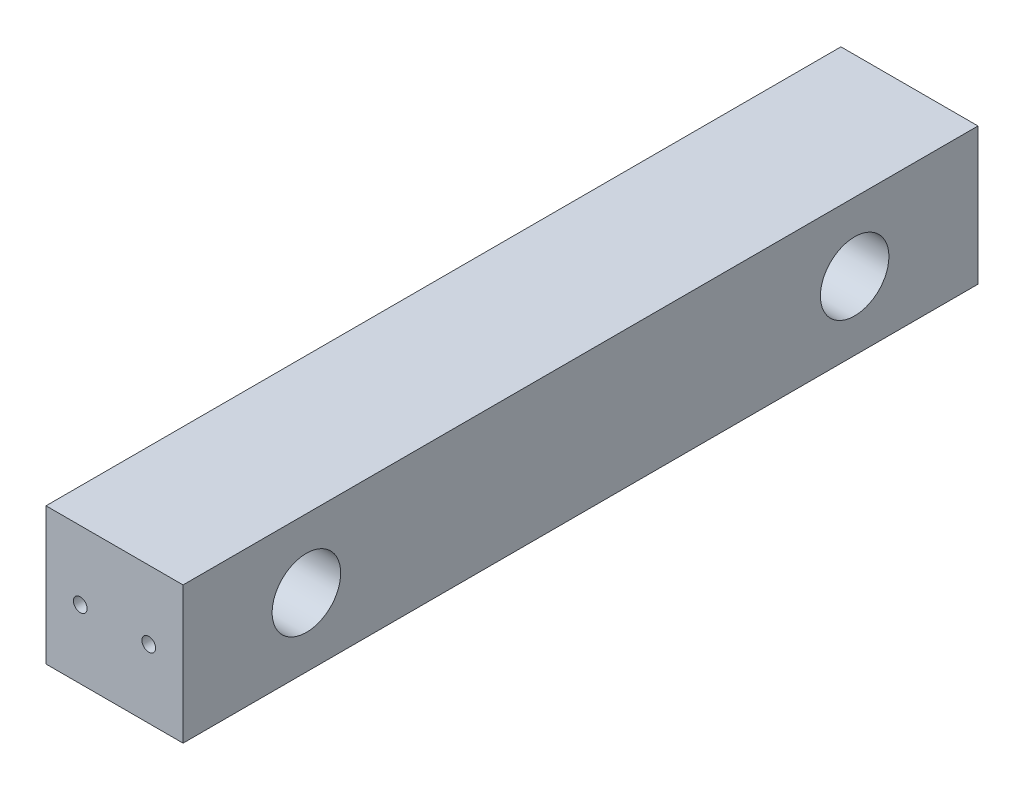
ISO-10303-21;
HEADER;
FILE_DESCRIPTION(('STEP AP214'),'2;1');
FILE_NAME('part.step','',(''),(''),'','','');
FILE_SCHEMA(('AUTOMOTIVE_DESIGN { 1 0 10303 214 1 1 1 1 }'));
ENDSEC;
DATA;
#1=APPLICATION_CONTEXT('core data for automotive mechanical design processes');
#2=APPLICATION_PROTOCOL_DEFINITION('international standard','automotive_design',2000,#1);
#3=PRODUCT_CONTEXT('',#1,'mechanical');
#4=PRODUCT('Part','Part','',(#3));
#5=PRODUCT_RELATED_PRODUCT_CATEGORY('part','',(#4));
#6=PRODUCT_DEFINITION_FORMATION('','',#4);
#7=PRODUCT_DEFINITION_CONTEXT('part definition',#1,'design');
#8=PRODUCT_DEFINITION('design','',#6,#7);
#9=PRODUCT_DEFINITION_SHAPE('','',#8);
#10=(LENGTH_UNIT() NAMED_UNIT(*) SI_UNIT(.MILLI.,.METRE.));
#11=(NAMED_UNIT(*) PLANE_ANGLE_UNIT() SI_UNIT($,.RADIAN.));
#12=(NAMED_UNIT(*) SI_UNIT($,.STERADIAN.) SOLID_ANGLE_UNIT());
#13=UNCERTAINTY_MEASURE_WITH_UNIT(LENGTH_MEASURE(1.E-05),#10,'distance_accuracy_value','');
#14=(GEOMETRIC_REPRESENTATION_CONTEXT(3) GLOBAL_UNCERTAINTY_ASSIGNED_CONTEXT((#13)) GLOBAL_UNIT_ASSIGNED_CONTEXT((#10,
#11,#12)) REPRESENTATION_CONTEXT('',''));
#15=CARTESIAN_POINT('',(0.,0.,0.));
#16=DIRECTION('',(0.,0.,1.));
#17=DIRECTION('',(1.,0.,0.));
#18=AXIS2_PLACEMENT_3D('',#15,#16,#17);
#19=CARTESIAN_POINT('',(20.,0.,116.));
#20=DIRECTION('',(-1.,0.,0.));
#21=DIRECTION('',(0.,0.,1.));
#22=AXIS2_PLACEMENT_3D('',#19,#20,#21);
#23=PLANE('',#22);
#24=DIRECTION('',(0.,1.,0.));
#25=VECTOR('',#24,1.);
#26=CARTESIAN_POINT('',(20.,0.,0.));
#27=LINE('',#26,#25);
#28=CARTESIAN_POINT('',(20.,0.,0.));
#29=VERTEX_POINT('',#28);
#30=CARTESIAN_POINT('',(20.,20.,0.));
#31=VERTEX_POINT('',#30);
#32=EDGE_CURVE('E92',#29,#31,#27,.T.);
#33=ORIENTED_EDGE('',*,*,#32,.T.);
#34=DIRECTION('',(0.,0.,-1.));
#35=VECTOR('',#34,1.);
#36=CARTESIAN_POINT('',(20.,20.,116.));
#37=LINE('',#36,#35);
#38=CARTESIAN_POINT('',(20.,20.,116.));
#39=VERTEX_POINT('',#38);
#40=EDGE_CURVE('E89',#39,#31,#37,.T.);
#41=ORIENTED_EDGE('',*,*,#40,.F.);
#42=DIRECTION('',(0.,1.,0.));
#43=VECTOR('',#42,1.);
#44=CARTESIAN_POINT('',(20.,0.,116.));
#45=LINE('',#44,#43);
#46=CARTESIAN_POINT('',(20.,0.,116.));
#47=VERTEX_POINT('',#46);
#48=EDGE_CURVE('E79',#47,#39,#45,.T.);
#49=ORIENTED_EDGE('',*,*,#48,.F.);
#50=DIRECTION('',(0.,0.,-1.));
#51=VECTOR('',#50,1.);
#52=CARTESIAN_POINT('',(20.,0.,116.));
#53=LINE('',#52,#51);
#54=EDGE_CURVE('E42',#47,#29,#53,.T.);
#55=ORIENTED_EDGE('',*,*,#54,.T.);
#56=EDGE_LOOP('',(#33,#41,#49,#55));
#57=FACE_BOUND('',#56,.T.);
#58=CARTESIAN_POINT('',(20.,10.,18.));
#59=DIRECTION('',(1.,0.,0.));
#60=DIRECTION('',(0.,0.,-1.));
#61=AXIS2_PLACEMENT_3D('',#58,#59,#60);
#62=CIRCLE('',#61,5.);
#63=CARTESIAN_POINT('',(20.,10.,13.));
#64=VERTEX_POINT('',#63);
#65=EDGE_CURVE('E129',#64,#64,#62,.F.);
#66=ORIENTED_EDGE('',*,*,#65,.T.);
#67=EDGE_LOOP('',(#66));
#68=FACE_BOUND('',#67,.T.);
#69=CARTESIAN_POINT('',(20.,10.,98.));
#70=DIRECTION('',(1.,0.,0.));
#71=DIRECTION('',(0.,0.,-1.));
#72=AXIS2_PLACEMENT_3D('',#69,#70,#71);
#73=CIRCLE('',#72,5.);
#74=CARTESIAN_POINT('',(20.,10.,93.));
#75=VERTEX_POINT('',#74);
#76=EDGE_CURVE('E119',#75,#75,#73,.T.);
#77=ORIENTED_EDGE('',*,*,#76,.F.);
#78=EDGE_LOOP('',(#77));
#79=FACE_BOUND('',#78,.T.);
#80=ADVANCED_FACE('F32',(#57,#68,#79),#23,.F.);
#81=CARTESIAN_POINT('',(0.,10.,18.));
#82=DIRECTION('',(1.,0.,0.));
#83=DIRECTION('',(0.,0.,-1.));
#84=AXIS2_PLACEMENT_3D('',#81,#82,#83);
#85=CYLINDRICAL_SURFACE('',#84,2.5);
#86=CARTESIAN_POINT('',(0.,10.,18.));
#87=DIRECTION('',(1.,0.,0.));
#88=DIRECTION('',(0.,0.,-1.));
#89=AXIS2_PLACEMENT_3D('',#86,#87,#88);
#90=CIRCLE('',#89,2.5);
#91=CARTESIAN_POINT('',(0.,10.,15.5));
#92=VERTEX_POINT('',#91);
#93=EDGE_CURVE('E117',#92,#92,#90,.F.);
#94=ORIENTED_EDGE('',*,*,#93,.T.);
#95=EDGE_LOOP('',(#94));
#96=FACE_BOUND('',#95,.T.);
#97=CARTESIAN_POINT('',(10.,10.,18.));
#98=DIRECTION('',(1.,0.,0.));
#99=DIRECTION('',(0.,0.,-1.));
#100=AXIS2_PLACEMENT_3D('',#97,#98,#99);
#101=CIRCLE('',#100,2.5);
#102=CARTESIAN_POINT('',(10.,10.,15.5));
#103=VERTEX_POINT('',#102);
#104=EDGE_CURVE('E36',#103,#103,#101,.T.);
#105=ORIENTED_EDGE('',*,*,#104,.T.);
#106=EDGE_LOOP('',(#105));
#107=FACE_BOUND('',#106,.T.);
#108=ADVANCED_FACE('F190',(#96,#107),#85,.F.);
#109=CARTESIAN_POINT('',(0.,10.,98.));
#110=DIRECTION('',(1.,0.,0.));
#111=DIRECTION('',(0.,0.,-1.));
#112=AXIS2_PLACEMENT_3D('',#109,#110,#111);
#113=CYLINDRICAL_SURFACE('',#112,2.5);
#114=CARTESIAN_POINT('',(0.,10.,98.));
#115=DIRECTION('',(1.,0.,0.));
#116=DIRECTION('',(0.,0.,-1.));
#117=AXIS2_PLACEMENT_3D('',#114,#115,#116);
#118=CIRCLE('',#117,2.5);
#119=CARTESIAN_POINT('',(0.,10.,95.5));
#120=VERTEX_POINT('',#119);
#121=EDGE_CURVE('E132',#120,#120,#118,.T.);
#122=ORIENTED_EDGE('',*,*,#121,.F.);
#123=EDGE_LOOP('',(#122));
#124=FACE_BOUND('',#123,.T.);
#125=CARTESIAN_POINT('',(10.,10.,98.));
#126=DIRECTION('',(1.,0.,0.));
#127=DIRECTION('',(0.,0.,-1.));
#128=AXIS2_PLACEMENT_3D('',#125,#126,#127);
#129=CIRCLE('',#128,2.5);
#130=CARTESIAN_POINT('',(10.,10.,95.5));
#131=VERTEX_POINT('',#130);
#132=EDGE_CURVE('E111',#131,#131,#129,.F.);
#133=ORIENTED_EDGE('',*,*,#132,.F.);
#134=EDGE_LOOP('',(#133));
#135=FACE_BOUND('',#134,.T.);
#136=ADVANCED_FACE('F195',(#124,#135),#113,.F.);
#137=CARTESIAN_POINT('',(0.,0.,116.));
#138=DIRECTION('',(-1.,0.,0.));
#139=DIRECTION('',(0.,-1.,0.));
#140=AXIS2_PLACEMENT_3D('',#137,#138,#139);
#141=PLANE('',#140);
#142=ORIENTED_EDGE('',*,*,#93,.F.);
#143=EDGE_LOOP('',(#142));
#144=FACE_BOUND('',#143,.T.);
#145=DIRECTION('',(0.,1.,0.));
#146=VECTOR('',#145,1.);
#147=CARTESIAN_POINT('',(0.,0.,0.));
#148=LINE('',#147,#146);
#149=CARTESIAN_POINT('',(0.,0.,0.));
#150=VERTEX_POINT('',#149);
#151=CARTESIAN_POINT('',(0.,20.,0.));
#152=VERTEX_POINT('',#151);
#153=EDGE_CURVE('E102',#150,#152,#148,.T.);
#154=ORIENTED_EDGE('',*,*,#153,.F.);
#155=DIRECTION('',(0.,0.,-1.));
#156=VECTOR('',#155,1.);
#157=CARTESIAN_POINT('',(0.,0.,116.));
#158=LINE('',#157,#156);
#159=CARTESIAN_POINT('',(0.,0.,116.));
#160=VERTEX_POINT('',#159);
#161=EDGE_CURVE('E11',#160,#150,#158,.T.);
#162=ORIENTED_EDGE('',*,*,#161,.F.);
#163=DIRECTION('',(0.,1.,0.));
#164=VECTOR('',#163,1.);
#165=CARTESIAN_POINT('',(0.,0.,116.));
#166=LINE('',#165,#164);
#167=CARTESIAN_POINT('',(0.,20.,116.));
#168=VERTEX_POINT('',#167);
#169=EDGE_CURVE('E96',#160,#168,#166,.T.);
#170=ORIENTED_EDGE('',*,*,#169,.T.);
#171=DIRECTION('',(0.,0.,-1.));
#172=VECTOR('',#171,1.);
#173=CARTESIAN_POINT('',(0.,20.,116.));
#174=LINE('',#173,#172);
#175=EDGE_CURVE('E74',#168,#152,#174,.T.);
#176=ORIENTED_EDGE('',*,*,#175,.T.);
#177=EDGE_LOOP('',(#154,#162,#170,#176));
#178=FACE_BOUND('',#177,.T.);
#179=ORIENTED_EDGE('',*,*,#121,.T.);
#180=EDGE_LOOP('',(#179));
#181=FACE_BOUND('',#180,.T.);
#182=ADVANCED_FACE('F34',(#144,#178,#181),#141,.T.);
#183=CARTESIAN_POINT('',(0.,0.,116.));
#184=DIRECTION('',(0.,0.,-1.));
#185=DIRECTION('',(-1.,0.,0.));
#186=AXIS2_PLACEMENT_3D('',#183,#184,#185);
#187=PLANE('',#186);
#188=CARTESIAN_POINT('',(5.,9.99999999999999,116.));
#189=DIRECTION('',(0.,0.,1.));
#190=DIRECTION('',(1.,0.,0.));
#191=AXIS2_PLACEMENT_3D('',#188,#189,#190);
#192=CIRCLE('',#191,1.);
#193=CARTESIAN_POINT('',(6.,9.99999999999999,116.));
#194=VERTEX_POINT('',#193);
#195=EDGE_CURVE('E145',#194,#194,#192,.T.);
#196=ORIENTED_EDGE('',*,*,#195,.F.);
#197=EDGE_LOOP('',(#196));
#198=FACE_BOUND('',#197,.T.);
#199=ORIENTED_EDGE('',*,*,#169,.F.);
#200=DIRECTION('',(1.,0.,0.));
#201=VECTOR('',#200,1.);
#202=CARTESIAN_POINT('',(0.,0.,116.));
#203=LINE('',#202,#201);
#204=EDGE_CURVE('E85',#160,#47,#203,.T.);
#205=ORIENTED_EDGE('',*,*,#204,.T.);
#206=ORIENTED_EDGE('',*,*,#48,.T.);
#207=DIRECTION('',(1.,0.,0.));
#208=VECTOR('',#207,1.);
#209=CARTESIAN_POINT('',(0.,20.,116.));
#210=LINE('',#209,#208);
#211=EDGE_CURVE('E84',#168,#39,#210,.T.);
#212=ORIENTED_EDGE('',*,*,#211,.F.);
#213=EDGE_LOOP('',(#199,#205,#206,#212));
#214=FACE_BOUND('',#213,.T.);
#215=CARTESIAN_POINT('',(15.,9.99999999999999,116.));
#216=DIRECTION('',(0.,0.,-1.));
#217=DIRECTION('',(-1.,0.,0.));
#218=AXIS2_PLACEMENT_3D('',#215,#216,#217);
#219=CIRCLE('',#218,1.);
#220=CARTESIAN_POINT('',(14.,9.99999999999999,116.));
#221=VERTEX_POINT('',#220);
#222=EDGE_CURVE('E142',#221,#221,#219,.T.);
#223=ORIENTED_EDGE('',*,*,#222,.T.);
#224=EDGE_LOOP('',(#223));
#225=FACE_BOUND('',#224,.T.);
#226=ADVANCED_FACE('F82',(#198,#214,#225),#187,.F.);
#227=CARTESIAN_POINT('',(0.,0.,0.));
#228=DIRECTION('',(0.,0.,-1.));
#229=DIRECTION('',(-1.,0.,0.));
#230=AXIS2_PLACEMENT_3D('',#227,#228,#229);
#231=PLANE('',#230);
#232=ORIENTED_EDGE('',*,*,#153,.T.);
#233=DIRECTION('',(1.,0.,0.));
#234=VECTOR('',#233,1.);
#235=CARTESIAN_POINT('',(0.,20.,0.));
#236=LINE('',#235,#234);
#237=EDGE_CURVE('E105',#152,#31,#236,.T.);
#238=ORIENTED_EDGE('',*,*,#237,.T.);
#239=ORIENTED_EDGE('',*,*,#32,.F.);
#240=DIRECTION('',(1.,0.,0.));
#241=VECTOR('',#240,1.);
#242=CARTESIAN_POINT('',(0.,0.,0.));
#243=LINE('',#242,#241);
#244=EDGE_CURVE('E66',#150,#29,#243,.T.);
#245=ORIENTED_EDGE('',*,*,#244,.F.);
#246=EDGE_LOOP('',(#232,#238,#239,#245));
#247=FACE_BOUND('',#246,.T.);
#248=CARTESIAN_POINT('',(5.,10.,0.));
#249=DIRECTION('',(0.,0.,-1.));
#250=DIRECTION('',(-1.,0.,0.));
#251=AXIS2_PLACEMENT_3D('',#248,#249,#250);
#252=CIRCLE('',#251,1.);
#253=CARTESIAN_POINT('',(4.,10.,0.));
#254=VERTEX_POINT('',#253);
#255=EDGE_CURVE('E155',#254,#254,#252,.T.);
#256=ORIENTED_EDGE('',*,*,#255,.F.);
#257=EDGE_LOOP('',(#256));
#258=FACE_BOUND('',#257,.T.);
#259=CARTESIAN_POINT('',(15.,10.,0.));
#260=DIRECTION('',(0.,0.,1.));
#261=DIRECTION('',(1.,0.,0.));
#262=AXIS2_PLACEMENT_3D('',#259,#260,#261);
#263=CIRCLE('',#262,1.);
#264=CARTESIAN_POINT('',(16.,10.,0.));
#265=VERTEX_POINT('',#264);
#266=EDGE_CURVE('E152',#265,#265,#263,.T.);
#267=ORIENTED_EDGE('',*,*,#266,.T.);
#268=EDGE_LOOP('',(#267));
#269=FACE_BOUND('',#268,.T.);
#270=ADVANCED_FACE('F168',(#247,#258,#269),#231,.T.);
#271=CARTESIAN_POINT('',(0.,0.,116.));
#272=DIRECTION('',(0.,1.,0.));
#273=DIRECTION('',(0.,0.,1.));
#274=AXIS2_PLACEMENT_3D('',#271,#272,#273);
#275=PLANE('',#274);
#276=ORIENTED_EDGE('',*,*,#244,.T.);
#277=ORIENTED_EDGE('',*,*,#54,.F.);
#278=ORIENTED_EDGE('',*,*,#204,.F.);
#279=ORIENTED_EDGE('',*,*,#161,.T.);
#280=EDGE_LOOP('',(#276,#277,#278,#279));
#281=FACE_BOUND('',#280,.T.);
#282=ADVANCED_FACE('F171',(#281),#275,.F.);
#283=CARTESIAN_POINT('',(0.,20.,116.));
#284=DIRECTION('',(0.,1.,0.));
#285=DIRECTION('',(-1.,0.,0.));
#286=AXIS2_PLACEMENT_3D('',#283,#284,#285);
#287=PLANE('',#286);
#288=ORIENTED_EDGE('',*,*,#237,.F.);
#289=ORIENTED_EDGE('',*,*,#175,.F.);
#290=ORIENTED_EDGE('',*,*,#211,.T.);
#291=ORIENTED_EDGE('',*,*,#40,.T.);
#292=EDGE_LOOP('',(#288,#289,#290,#291));
#293=FACE_BOUND('',#292,.T.);
#294=ADVANCED_FACE('F95',(#293),#287,.T.);
#295=CARTESIAN_POINT('',(5.,10.,10.));
#296=DIRECTION('',(0.,0.,-1.));
#297=DIRECTION('',(-1.,0.,0.));
#298=AXIS2_PLACEMENT_3D('',#295,#296,#297);
#299=CYLINDRICAL_SURFACE('',#298,1.);
#300=CARTESIAN_POINT('',(5.,10.,10.));
#301=DIRECTION('',(0.,0.,-1.));
#302=DIRECTION('',(-1.,0.,0.));
#303=AXIS2_PLACEMENT_3D('',#300,#301,#302);
#304=CIRCLE('',#303,1.);
#305=CARTESIAN_POINT('',(4.,10.,10.));
#306=VERTEX_POINT('',#305);
#307=EDGE_CURVE('E141',#306,#306,#304,.T.);
#308=ORIENTED_EDGE('',*,*,#307,.F.);
#309=EDGE_LOOP('',(#308));
#310=FACE_BOUND('',#309,.T.);
#311=ORIENTED_EDGE('',*,*,#255,.T.);
#312=EDGE_LOOP('',(#311));
#313=FACE_BOUND('',#312,.T.);
#314=ADVANCED_FACE('F162',(#310,#313),#299,.F.);
#315=CARTESIAN_POINT('',(5.,10.,10.));
#316=DIRECTION('',(0.,0.,-1.));
#317=DIRECTION('',(-1.,0.,0.));
#318=AXIS2_PLACEMENT_3D('',#315,#316,#317);
#319=PLANE('',#318);
#320=ORIENTED_EDGE('',*,*,#307,.T.);
#321=EDGE_LOOP('',(#320));
#322=FACE_BOUND('',#321,.T.);
#323=ADVANCED_FACE('F160',(#322),#319,.T.);
#324=CARTESIAN_POINT('',(15.,10.,10.));
#325=DIRECTION('',(0.,0.,-1.));
#326=DIRECTION('',(-1.,0.,0.));
#327=AXIS2_PLACEMENT_3D('',#324,#325,#326);
#328=CYLINDRICAL_SURFACE('',#327,1.);
#329=CARTESIAN_POINT('',(15.,10.,10.));
#330=DIRECTION('',(0.,0.,1.));
#331=DIRECTION('',(1.,0.,0.));
#332=AXIS2_PLACEMENT_3D('',#329,#330,#331);
#333=CIRCLE('',#332,1.);
#334=CARTESIAN_POINT('',(16.,10.,10.));
#335=VERTEX_POINT('',#334);
#336=EDGE_CURVE('E106',#335,#335,#333,.T.);
#337=ORIENTED_EDGE('',*,*,#336,.T.);
#338=EDGE_LOOP('',(#337));
#339=FACE_BOUND('',#338,.T.);
#340=ORIENTED_EDGE('',*,*,#266,.F.);
#341=EDGE_LOOP('',(#340));
#342=FACE_BOUND('',#341,.T.);
#343=ADVANCED_FACE('F176',(#339,#342),#328,.F.);
#344=CARTESIAN_POINT('',(15.,10.,10.));
#345=DIRECTION('',(0.,0.,1.));
#346=DIRECTION('',(1.,0.,0.));
#347=AXIS2_PLACEMENT_3D('',#344,#345,#346);
#348=PLANE('',#347);
#349=ORIENTED_EDGE('',*,*,#336,.F.);
#350=EDGE_LOOP('',(#349));
#351=FACE_BOUND('',#350,.T.);
#352=ADVANCED_FACE('F178',(#351),#348,.F.);
#353=CARTESIAN_POINT('',(5.,9.99999999999999,106.));
#354=DIRECTION('',(0.,0.,1.));
#355=DIRECTION('',(1.,0.,0.));
#356=AXIS2_PLACEMENT_3D('',#353,#354,#355);
#357=CYLINDRICAL_SURFACE('',#356,1.);
#358=CARTESIAN_POINT('',(5.,9.99999999999999,106.));
#359=DIRECTION('',(0.,0.,1.));
#360=DIRECTION('',(1.,0.,0.));
#361=AXIS2_PLACEMENT_3D('',#358,#359,#360);
#362=CIRCLE('',#361,1.);
#363=CARTESIAN_POINT('',(6.,9.99999999999999,106.));
#364=VERTEX_POINT('',#363);
#365=EDGE_CURVE('E135',#364,#364,#362,.T.);
#366=ORIENTED_EDGE('',*,*,#365,.F.);
#367=EDGE_LOOP('',(#366));
#368=FACE_BOUND('',#367,.T.);
#369=ORIENTED_EDGE('',*,*,#195,.T.);
#370=EDGE_LOOP('',(#369));
#371=FACE_BOUND('',#370,.T.);
#372=ADVANCED_FACE('F185',(#368,#371),#357,.F.);
#373=CARTESIAN_POINT('',(5.,9.99999999999999,106.));
#374=DIRECTION('',(0.,0.,1.));
#375=DIRECTION('',(1.,0.,0.));
#376=AXIS2_PLACEMENT_3D('',#373,#374,#375);
#377=PLANE('',#376);
#378=ORIENTED_EDGE('',*,*,#365,.T.);
#379=EDGE_LOOP('',(#378));
#380=FACE_BOUND('',#379,.T.);
#381=ADVANCED_FACE('F296',(#380),#377,.T.);
#382=CARTESIAN_POINT('',(15.,9.99999999999999,106.));
#383=DIRECTION('',(0.,0.,1.));
#384=DIRECTION('',(1.,0.,0.));
#385=AXIS2_PLACEMENT_3D('',#382,#383,#384);
#386=CYLINDRICAL_SURFACE('',#385,1.);
#387=CARTESIAN_POINT('',(15.,9.99999999999999,106.));
#388=DIRECTION('',(0.,0.,-1.));
#389=DIRECTION('',(-1.,0.,0.));
#390=AXIS2_PLACEMENT_3D('',#387,#388,#389);
#391=CIRCLE('',#390,1.);
#392=CARTESIAN_POINT('',(14.,9.99999999999999,106.));
#393=VERTEX_POINT('',#392);
#394=EDGE_CURVE('E138',#393,#393,#391,.T.);
#395=ORIENTED_EDGE('',*,*,#394,.T.);
#396=EDGE_LOOP('',(#395));
#397=FACE_BOUND('',#396,.T.);
#398=ORIENTED_EDGE('',*,*,#222,.F.);
#399=EDGE_LOOP('',(#398));
#400=FACE_BOUND('',#399,.T.);
#401=ADVANCED_FACE('F288',(#397,#400),#386,.F.);
#402=CARTESIAN_POINT('',(15.,9.99999999999999,106.));
#403=DIRECTION('',(0.,0.,-1.));
#404=DIRECTION('',(-1.,0.,0.));
#405=AXIS2_PLACEMENT_3D('',#402,#403,#404);
#406=PLANE('',#405);
#407=ORIENTED_EDGE('',*,*,#394,.F.);
#408=EDGE_LOOP('',(#407));
#409=FACE_BOUND('',#408,.T.);
#410=ADVANCED_FACE('F253',(#409),#406,.F.);
#411=CARTESIAN_POINT('',(10.,0.,0.));
#412=DIRECTION('',(1.,0.,0.));
#413=DIRECTION('',(0.,0.,-1.));
#414=AXIS2_PLACEMENT_3D('',#411,#412,#413);
#415=PLANE('',#414);
#416=CARTESIAN_POINT('',(10.,10.,98.));
#417=DIRECTION('',(1.,0.,0.));
#418=DIRECTION('',(0.,0.,-1.));
#419=AXIS2_PLACEMENT_3D('',#416,#417,#418);
#420=CIRCLE('',#419,5.);
#421=CARTESIAN_POINT('',(10.,10.,93.));
#422=VERTEX_POINT('',#421);
#423=EDGE_CURVE('E113',#422,#422,#420,.T.);
#424=ORIENTED_EDGE('',*,*,#423,.T.);
#425=EDGE_LOOP('',(#424));
#426=FACE_BOUND('',#425,.T.);
#427=ORIENTED_EDGE('',*,*,#132,.T.);
#428=EDGE_LOOP('',(#427));
#429=FACE_BOUND('',#428,.T.);
#430=ADVANCED_FACE('F247',(#426,#429),#415,.T.);
#431=CARTESIAN_POINT('',(10.,10.,98.));
#432=DIRECTION('',(1.,0.,0.));
#433=DIRECTION('',(0.,0.,-1.));
#434=AXIS2_PLACEMENT_3D('',#431,#432,#433);
#435=CYLINDRICAL_SURFACE('',#434,5.);
#436=ORIENTED_EDGE('',*,*,#423,.F.);
#437=EDGE_LOOP('',(#436));
#438=FACE_BOUND('',#437,.T.);
#439=ORIENTED_EDGE('',*,*,#76,.T.);
#440=EDGE_LOOP('',(#439));
#441=FACE_BOUND('',#440,.T.);
#442=ADVANCED_FACE('F252',(#438,#441),#435,.F.);
#443=CARTESIAN_POINT('',(10.,10.,18.));
#444=DIRECTION('',(1.,0.,0.));
#445=DIRECTION('',(0.,0.,-1.));
#446=AXIS2_PLACEMENT_3D('',#443,#444,#445);
#447=CYLINDRICAL_SURFACE('',#446,5.);
#448=CARTESIAN_POINT('',(10.,10.,18.));
#449=DIRECTION('',(1.,0.,0.));
#450=DIRECTION('',(0.,0.,-1.));
#451=AXIS2_PLACEMENT_3D('',#448,#449,#450);
#452=CIRCLE('',#451,5.);
#453=CARTESIAN_POINT('',(10.,10.,13.));
#454=VERTEX_POINT('',#453);
#455=EDGE_CURVE('E124',#454,#454,#452,.F.);
#456=ORIENTED_EDGE('',*,*,#455,.T.);
#457=EDGE_LOOP('',(#456));
#458=FACE_BOUND('',#457,.T.);
#459=ORIENTED_EDGE('',*,*,#65,.F.);
#460=EDGE_LOOP('',(#459));
#461=FACE_BOUND('',#460,.T.);
#462=ADVANCED_FACE('F261',(#458,#461),#447,.F.);
#463=CARTESIAN_POINT('',(10.,0.,0.));
#464=DIRECTION('',(1.,0.,0.));
#465=DIRECTION('',(0.,0.,-1.));
#466=AXIS2_PLACEMENT_3D('',#463,#464,#465);
#467=PLANE('',#466);
#468=ORIENTED_EDGE('',*,*,#104,.F.);
#469=EDGE_LOOP('',(#468));
#470=FACE_BOUND('',#469,.T.);
#471=ORIENTED_EDGE('',*,*,#455,.F.);
#472=EDGE_LOOP('',(#471));
#473=FACE_BOUND('',#472,.T.);
#474=ADVANCED_FACE('F270',(#470,#473),#467,.T.);
#475=CLOSED_SHELL('',(#80,#108,#136,#182,#226,#270,#282,#294,#314,#323,#343,#352,#372,#381,#401,
#410,#430,#442,#462,#474));
#476=MANIFOLD_SOLID_BREP('B2',#475);
#477=ADVANCED_BREP_SHAPE_REPRESENTATION('',(#18,#476),#14);
#478=SHAPE_DEFINITION_REPRESENTATION(#9,#477);
ENDSEC;
END-ISO-10303-21;
